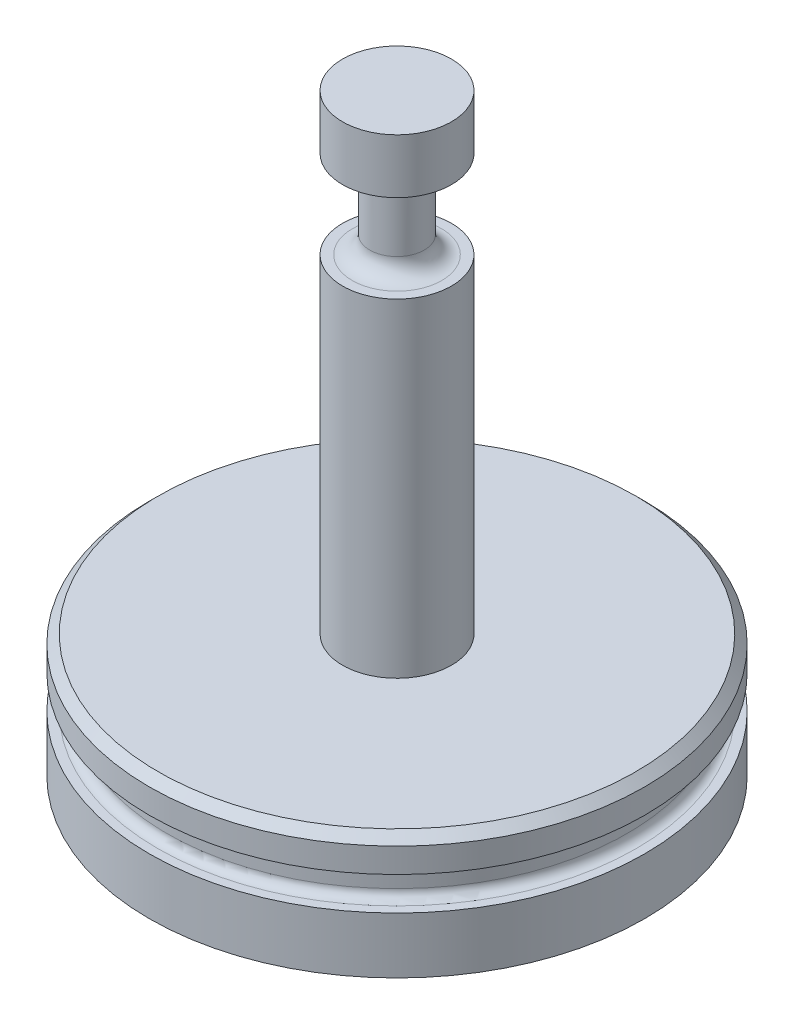
ISO-10303-21;
HEADER;
FILE_DESCRIPTION(('STEP AP214'),'2;1');
FILE_NAME('part.step','',(''),(''),'','','');
FILE_SCHEMA(('AUTOMOTIVE_DESIGN { 1 0 10303 214 1 1 1 1 }'));
ENDSEC;
DATA;
#1=APPLICATION_CONTEXT('core data for automotive mechanical design processes');
#2=APPLICATION_PROTOCOL_DEFINITION('international standard','automotive_design',2000,#1);
#3=PRODUCT_CONTEXT('',#1,'mechanical');
#4=PRODUCT('Part','Part','',(#3));
#5=PRODUCT_RELATED_PRODUCT_CATEGORY('part','',(#4));
#6=PRODUCT_DEFINITION_FORMATION('','',#4);
#7=PRODUCT_DEFINITION_CONTEXT('part definition',#1,'design');
#8=PRODUCT_DEFINITION('design','',#6,#7);
#9=PRODUCT_DEFINITION_SHAPE('','',#8);
#10=(LENGTH_UNIT() NAMED_UNIT(*) SI_UNIT(.MILLI.,.METRE.));
#11=(NAMED_UNIT(*) PLANE_ANGLE_UNIT() SI_UNIT($,.RADIAN.));
#12=(NAMED_UNIT(*) SI_UNIT($,.STERADIAN.) SOLID_ANGLE_UNIT());
#13=UNCERTAINTY_MEASURE_WITH_UNIT(LENGTH_MEASURE(1.E-05),#10,'distance_accuracy_value','');
#14=(GEOMETRIC_REPRESENTATION_CONTEXT(3) GLOBAL_UNCERTAINTY_ASSIGNED_CONTEXT((#13)) GLOBAL_UNIT_ASSIGNED_CONTEXT((#10,
#11,#12)) REPRESENTATION_CONTEXT('',''));
#15=CARTESIAN_POINT('',(0.,0.,0.));
#16=DIRECTION('',(0.,0.,1.));
#17=DIRECTION('',(1.,0.,0.));
#18=AXIS2_PLACEMENT_3D('',#15,#16,#17);
#19=CARTESIAN_POINT('',(0.,8.5852,0.));
#20=DIRECTION('',(0.,-1.,0.));
#21=DIRECTION('',(0.,0.,-1.));
#22=AXIS2_PLACEMENT_3D('',#19,#20,#21);
#23=PLANE('',#22);
#24=CARTESIAN_POINT('',(0.,8.5852,0.));
#25=DIRECTION('',(0.,-1.,0.));
#26=DIRECTION('',(0.,0.,-1.));
#27=AXIS2_PLACEMENT_3D('',#24,#25,#26);
#28=CIRCLE('',#27,0.7874);
#29=CARTESIAN_POINT('',(0.,8.5852,-0.7874));
#30=VERTEX_POINT('',#29);
#31=EDGE_CURVE('E238',#30,#30,#28,.T.);
#32=ORIENTED_EDGE('',*,*,#31,.F.);
#33=EDGE_LOOP('',(#32));
#34=FACE_BOUND('',#33,.T.);
#35=ADVANCED_FACE('F16',(#34),#23,.F.);
#36=CARTESIAN_POINT('',(0.,8.92556,0.));
#37=DIRECTION('',(0.,-1.,0.));
#38=DIRECTION('',(0.,0.,-1.));
#39=AXIS2_PLACEMENT_3D('',#36,#37,#38);
#40=CYLINDRICAL_SURFACE('',#39,0.7874);
#41=CARTESIAN_POINT('',(0.,7.7978,0.));
#42=DIRECTION('',(0.,-1.,0.));
#43=DIRECTION('',(0.,0.,-1.));
#44=AXIS2_PLACEMENT_3D('',#41,#42,#43);
#45=CIRCLE('',#44,0.7874);
#46=CARTESIAN_POINT('',(0.,7.7978,-0.7874));
#47=VERTEX_POINT('',#46);
#48=EDGE_CURVE('E64',#47,#47,#45,.T.);
#49=ORIENTED_EDGE('',*,*,#48,.F.);
#50=EDGE_LOOP('',(#49));
#51=FACE_BOUND('',#50,.T.);
#52=ORIENTED_EDGE('',*,*,#31,.T.);
#53=EDGE_LOOP('',(#52));
#54=FACE_BOUND('',#53,.T.);
#55=ADVANCED_FACE('F242',(#51,#54),#40,.T.);
#56=CARTESIAN_POINT('',(0.,7.7978,0.));
#57=DIRECTION('',(0.,-1.,0.));
#58=DIRECTION('',(0.,0.,-1.));
#59=AXIS2_PLACEMENT_3D('',#56,#57,#58);
#60=PLANE('',#59);
#61=CARTESIAN_POINT('',(0.,7.79779999999973,0.));
#62=DIRECTION('',(0.,-1.,0.));
#63=DIRECTION('',(1.,0.,0.));
#64=AXIS2_PLACEMENT_3D('',#61,#62,#63);
#65=CIRCLE('',#64,0.647699626490841);
#66=CARTESIAN_POINT('',(-0.647699477087177,7.79779999999983,0.));
#67=VERTEX_POINT('',#66);
#68=CARTESIAN_POINT('',(0.647699477087177,7.79779999999983,0.));
#69=VERTEX_POINT('',#68);
#70=EDGE_CURVE('E62',#67,#69,#65,.F.);
#71=ORIENTED_EDGE('',*,*,#70,.T.);
#72=CARTESIAN_POINT('',(0.,7.7977999999989,0.));
#73=DIRECTION('',(0.,-1.,0.));
#74=DIRECTION('',(-1.,0.,0.));
#75=AXIS2_PLACEMENT_3D('',#72,#73,#74);
#76=CIRCLE('',#75,0.647699252981682);
#77=EDGE_CURVE('E56',#69,#67,#76,.F.);
#78=ORIENTED_EDGE('',*,*,#77,.T.);
#79=EDGE_LOOP('',(#71,#78));
#80=FACE_BOUND('',#79,.T.);
#81=ORIENTED_EDGE('',*,*,#48,.T.);
#82=EDGE_LOOP('',(#81));
#83=FACE_BOUND('',#82,.T.);
#84=ADVANCED_FACE('F60',(#80,#83),#60,.T.);
#85=CARTESIAN_POINT('',(0.,7.5438,0.));
#86=DIRECTION('',(0.,-1.,0.));
#87=DIRECTION('',(0.998655321020781,0.,-0.051841583664869));
#88=AXIS2_PLACEMENT_3D('',#85,#86,#87);
#89=TOROIDAL_SURFACE('',#88,0.6477,0.254);
#90=CARTESIAN_POINT('',(0.,7.5438,0.));
#91=DIRECTION('',(0.,-1.,0.));
#92=DIRECTION('',(0.,0.,-1.));
#93=AXIS2_PLACEMENT_3D('',#90,#91,#92);
#94=CIRCLE('',#93,0.3937);
#95=CARTESIAN_POINT('',(0.,7.5438,-0.3937));
#96=VERTEX_POINT('',#95);
#97=EDGE_CURVE('E69',#96,#96,#94,.T.);
#98=ORIENTED_EDGE('',*,*,#97,.F.);
#99=EDGE_LOOP('',(#98));
#100=FACE_BOUND('',#99,.T.);
#101=ORIENTED_EDGE('',*,*,#70,.F.);
#102=ORIENTED_EDGE('',*,*,#77,.F.);
#103=EDGE_LOOP('',(#101,#102));
#104=FACE_BOUND('',#103,.T.);
#105=ADVANCED_FACE('F68',(#100,#104),#89,.F.);
#106=CARTESIAN_POINT('',(0.,8.92556,0.));
#107=DIRECTION('',(0.,-1.,0.));
#108=DIRECTION('',(0.,0.,-1.));
#109=AXIS2_PLACEMENT_3D('',#106,#107,#108);
#110=CYLINDRICAL_SURFACE('',#109,0.3937);
#111=ORIENTED_EDGE('',*,*,#97,.T.);
#112=EDGE_LOOP('',(#111));
#113=FACE_BOUND('',#112,.T.);
#114=CARTESIAN_POINT('',(0.,6.7818,0.));
#115=DIRECTION('',(0.,-1.,0.));
#116=DIRECTION('',(0.998522522331282,0.,-0.054339418447149));
#117=AXIS2_PLACEMENT_3D('',#114,#115,#116);
#118=CIRCLE('',#117,0.3937);
#119=CARTESIAN_POINT('',(0.393118317041826,6.7818,-0.0213934290426426));
#120=VERTEX_POINT('',#119);
#121=EDGE_CURVE('E102',#120,#120,#118,.F.);
#122=ORIENTED_EDGE('',*,*,#121,.T.);
#123=EDGE_LOOP('',(#122));
#124=FACE_BOUND('',#123,.T.);
#125=ADVANCED_FACE('F86',(#113,#124),#110,.T.);
#126=CARTESIAN_POINT('',(0.,6.7818,0.));
#127=DIRECTION('',(0.,-1.,0.));
#128=DIRECTION('',(0.998522522331282,0.,-0.054339418447149));
#129=AXIS2_PLACEMENT_3D('',#126,#127,#128);
#130=TOROIDAL_SURFACE('',#129,0.6477,0.254);
#131=CARTESIAN_POINT('',(0.,6.52780000000011,0.));
#132=DIRECTION('',(0.,1.,0.));
#133=DIRECTION('',(-1.,0.,0.));
#134=AXIS2_PLACEMENT_3D('',#131,#132,#133);
#135=CIRCLE('',#134,0.647699760850237);
#136=CARTESIAN_POINT('',(-0.647699665190332,6.52780000000007,0.));
#137=VERTEX_POINT('',#136);
#138=CARTESIAN_POINT('',(0.647699665190332,6.52780000000007,0.));
#139=VERTEX_POINT('',#138);
#140=EDGE_CURVE('E138',#137,#139,#135,.T.);
#141=ORIENTED_EDGE('',*,*,#140,.T.);
#142=CARTESIAN_POINT('',(0.,6.52780000000045,0.));
#143=DIRECTION('',(0.,1.,0.));
#144=DIRECTION('',(1.,0.,0.));
#145=AXIS2_PLACEMENT_3D('',#142,#143,#144);
#146=CIRCLE('',#145,0.647699521700474);
#147=EDGE_CURVE('E105',#139,#137,#146,.T.);
#148=ORIENTED_EDGE('',*,*,#147,.T.);
#149=EDGE_LOOP('',(#141,#148));
#150=FACE_BOUND('',#149,.T.);
#151=ORIENTED_EDGE('',*,*,#121,.F.);
#152=EDGE_LOOP('',(#151));
#153=FACE_BOUND('',#152,.T.);
#154=ADVANCED_FACE('F110',(#150,#153),#130,.F.);
#155=CARTESIAN_POINT('',(0.,6.5278,0.));
#156=DIRECTION('',(0.,-1.,0.));
#157=DIRECTION('',(0.,0.,-1.));
#158=AXIS2_PLACEMENT_3D('',#155,#156,#157);
#159=PLANE('',#158);
#160=ORIENTED_EDGE('',*,*,#147,.F.);
#161=ORIENTED_EDGE('',*,*,#140,.F.);
#162=EDGE_LOOP('',(#160,#161));
#163=FACE_BOUND('',#162,.T.);
#164=CARTESIAN_POINT('',(0.,6.5278,0.));
#165=DIRECTION('',(0.,-1.,0.));
#166=DIRECTION('',(0.,0.,-1.));
#167=AXIS2_PLACEMENT_3D('',#164,#165,#166);
#168=CIRCLE('',#167,0.7874);
#169=CARTESIAN_POINT('',(0.,6.5278,-0.7874));
#170=VERTEX_POINT('',#169);
#171=EDGE_CURVE('E226',#170,#170,#168,.T.);
#172=ORIENTED_EDGE('',*,*,#171,.F.);
#173=EDGE_LOOP('',(#172));
#174=FACE_BOUND('',#173,.T.);
#175=ADVANCED_FACE('F119',(#163,#174),#159,.F.);
#176=CARTESIAN_POINT('',(0.,8.92556,0.));
#177=DIRECTION('',(0.,-1.,0.));
#178=DIRECTION('',(0.,0.,-1.));
#179=AXIS2_PLACEMENT_3D('',#176,#177,#178);
#180=CYLINDRICAL_SURFACE('',#179,0.7874);
#181=ORIENTED_EDGE('',*,*,#171,.T.);
#182=EDGE_LOOP('',(#181));
#183=FACE_BOUND('',#182,.T.);
#184=CARTESIAN_POINT('',(0.,1.778,0.));
#185=DIRECTION('',(0.,-1.,0.));
#186=DIRECTION('',(0.,0.,-1.));
#187=AXIS2_PLACEMENT_3D('',#184,#185,#186);
#188=CIRCLE('',#187,0.7874);
#189=CARTESIAN_POINT('',(0.,1.778,-0.7874));
#190=VERTEX_POINT('',#189);
#191=EDGE_CURVE('E228',#190,#190,#188,.F.);
#192=ORIENTED_EDGE('',*,*,#191,.T.);
#193=EDGE_LOOP('',(#192));
#194=FACE_BOUND('',#193,.T.);
#195=ADVANCED_FACE('F375',(#183,#194),#180,.T.);
#196=CARTESIAN_POINT('',(0.,1.778,0.));
#197=DIRECTION('',(0.,-1.,0.));
#198=DIRECTION('',(0.,0.,-1.));
#199=AXIS2_PLACEMENT_3D('',#196,#197,#198);
#200=PLANE('',#199);
#201=ORIENTED_EDGE('',*,*,#191,.F.);
#202=EDGE_LOOP('',(#201));
#203=FACE_BOUND('',#202,.T.);
#204=CARTESIAN_POINT('',(0.,1.77800000000161,0.));
#205=DIRECTION('',(0.,-1.,0.));
#206=DIRECTION('',(0.,0.,-1.));
#207=AXIS2_PLACEMENT_3D('',#204,#205,#206);
#208=CIRCLE('',#207,3.45440000000963);
#209=CARTESIAN_POINT('',(0.,1.77800000000161,-3.45440000000963));
#210=VERTEX_POINT('',#209);
#211=EDGE_CURVE('E152',#210,#210,#208,.T.);
#212=ORIENTED_EDGE('',*,*,#211,.F.);
#213=EDGE_LOOP('',(#212));
#214=FACE_BOUND('',#213,.T.);
#215=ADVANCED_FACE('F366',(#203,#214),#200,.F.);
#216=CARTESIAN_POINT('',(0.,1.65100000003804,0.));
#217=DIRECTION('',(0.,-1.,0.));
#218=DIRECTION('',(0.,0.,-1.));
#219=AXIS2_PLACEMENT_3D('',#216,#217,#218);
#220=CONICAL_SURFACE('',#219,3.58140000003004,0.785398163621241);
#221=CARTESIAN_POINT('',(0.,1.651,0.));
#222=DIRECTION('',(0.,-1.,0.));
#223=DIRECTION('',(0.,0.,-1.));
#224=AXIS2_PLACEMENT_3D('',#221,#222,#223);
#225=CIRCLE('',#224,3.5814);
#226=CARTESIAN_POINT('',(0.,1.651,-3.5814));
#227=VERTEX_POINT('',#226);
#228=EDGE_CURVE('E148',#227,#227,#225,.T.);
#229=ORIENTED_EDGE('',*,*,#228,.F.);
#230=EDGE_LOOP('',(#229));
#231=FACE_BOUND('',#230,.T.);
#232=ORIENTED_EDGE('',*,*,#211,.T.);
#233=EDGE_LOOP('',(#232));
#234=FACE_BOUND('',#233,.T.);
#235=ADVANCED_FACE('F358',(#231,#234),#220,.T.);
#236=CARTESIAN_POINT('',(0.,1.8669,0.));
#237=DIRECTION('',(0.,-1.,0.));
#238=DIRECTION('',(0.,0.,-1.));
#239=AXIS2_PLACEMENT_3D('',#236,#237,#238);
#240=CYLINDRICAL_SURFACE('',#239,3.5814);
#241=CARTESIAN_POINT('',(0.,1.2954,0.));
#242=DIRECTION('',(0.,-1.,0.));
#243=DIRECTION('',(0.,0.,-1.));
#244=AXIS2_PLACEMENT_3D('',#241,#242,#243);
#245=CIRCLE('',#244,3.5814);
#246=CARTESIAN_POINT('',(0.,1.2954,-3.5814));
#247=VERTEX_POINT('',#246);
#248=EDGE_CURVE('E151',#247,#247,#245,.T.);
#249=ORIENTED_EDGE('',*,*,#248,.F.);
#250=EDGE_LOOP('',(#249));
#251=FACE_BOUND('',#250,.T.);
#252=ORIENTED_EDGE('',*,*,#228,.T.);
#253=EDGE_LOOP('',(#252));
#254=FACE_BOUND('',#253,.T.);
#255=ADVANCED_FACE('F351',(#251,#254),#240,.T.);
#256=CARTESIAN_POINT('',(0.,1.2954,0.));
#257=DIRECTION('',(0.,-1.,0.));
#258=DIRECTION('',(0.,0.,-1.));
#259=AXIS2_PLACEMENT_3D('',#256,#257,#258);
#260=PLANE('',#259);
#261=CARTESIAN_POINT('',(0.,1.2954,0.));
#262=DIRECTION('',(0.,-1.,0.));
#263=DIRECTION('',(1.,0.,0.));
#264=AXIS2_PLACEMENT_3D('',#261,#262,#263);
#265=CIRCLE('',#264,3.4544);
#266=CARTESIAN_POINT('',(-3.4544,1.2954,0.));
#267=VERTEX_POINT('',#266);
#268=CARTESIAN_POINT('',(3.4544,1.2954,0.));
#269=VERTEX_POINT('',#268);
#270=EDGE_CURVE('E185',#267,#269,#265,.F.);
#271=ORIENTED_EDGE('',*,*,#270,.T.);
#272=CARTESIAN_POINT('',(0.,1.2954,0.));
#273=DIRECTION('',(0.,-1.,0.));
#274=DIRECTION('',(-1.,0.,0.));
#275=AXIS2_PLACEMENT_3D('',#272,#273,#274);
#276=CIRCLE('',#275,3.4544);
#277=EDGE_CURVE('E194',#269,#267,#276,.F.);
#278=ORIENTED_EDGE('',*,*,#277,.T.);
#279=EDGE_LOOP('',(#271,#278));
#280=FACE_BOUND('',#279,.T.);
#281=ORIENTED_EDGE('',*,*,#248,.T.);
#282=EDGE_LOOP('',(#281));
#283=FACE_BOUND('',#282,.T.);
#284=ADVANCED_FACE('F171',(#280,#283),#260,.T.);
#285=CARTESIAN_POINT('',(0.,1.1684,0.));
#286=DIRECTION('',(0.,-1.,0.));
#287=DIRECTION('',(-1.,0.,0.));
#288=AXIS2_PLACEMENT_3D('',#285,#286,#287);
#289=TOROIDAL_SURFACE('',#288,3.4544,0.127);
#290=ORIENTED_EDGE('',*,*,#277,.F.);
#291=ORIENTED_EDGE('',*,*,#270,.F.);
#292=EDGE_LOOP('',(#290,#291));
#293=FACE_BOUND('',#292,.T.);
#294=CARTESIAN_POINT('',(0.,1.1684,0.));
#295=DIRECTION('',(0.,-1.,0.));
#296=DIRECTION('',(0.,0.,-1.));
#297=AXIS2_PLACEMENT_3D('',#294,#295,#296);
#298=CIRCLE('',#297,3.3274);
#299=CARTESIAN_POINT('',(0.,1.1684,-3.3274));
#300=VERTEX_POINT('',#299);
#301=EDGE_CURVE('E180',#300,#300,#298,.T.);
#302=ORIENTED_EDGE('',*,*,#301,.F.);
#303=EDGE_LOOP('',(#302));
#304=FACE_BOUND('',#303,.T.);
#305=ADVANCED_FACE('F159',(#293,#304),#289,.F.);
#306=CARTESIAN_POINT('',(0.,1.8669,0.));
#307=DIRECTION('',(0.,-1.,0.));
#308=DIRECTION('',(0.,0.,-1.));
#309=AXIS2_PLACEMENT_3D('',#306,#307,#308);
#310=CYLINDRICAL_SURFACE('',#309,3.3274);
#311=ORIENTED_EDGE('',*,*,#301,.T.);
#312=EDGE_LOOP('',(#311));
#313=FACE_BOUND('',#312,.T.);
#314=CARTESIAN_POINT('',(0.,0.9398,0.));
#315=DIRECTION('',(0.,-1.,0.));
#316=DIRECTION('',(-1.,0.,0.));
#317=AXIS2_PLACEMENT_3D('',#314,#315,#316);
#318=CIRCLE('',#317,3.3274);
#319=CARTESIAN_POINT('',(-3.3274,0.9398,0.));
#320=VERTEX_POINT('',#319);
#321=EDGE_CURVE('E286',#320,#320,#318,.F.);
#322=ORIENTED_EDGE('',*,*,#321,.T.);
#323=EDGE_LOOP('',(#322));
#324=FACE_BOUND('',#323,.T.);
#325=ADVANCED_FACE('F170',(#313,#324),#310,.T.);
#326=CARTESIAN_POINT('',(0.,0.9398,0.));
#327=DIRECTION('',(0.,-1.,0.));
#328=DIRECTION('',(-1.,0.,0.));
#329=AXIS2_PLACEMENT_3D('',#326,#327,#328);
#330=TOROIDAL_SURFACE('',#329,3.4544,0.127);
#331=ORIENTED_EDGE('',*,*,#321,.F.);
#332=EDGE_LOOP('',(#331));
#333=FACE_BOUND('',#332,.T.);
#334=CARTESIAN_POINT('',(0.,0.8128,0.));
#335=DIRECTION('',(0.,1.,0.));
#336=DIRECTION('',(1.,0.,0.));
#337=AXIS2_PLACEMENT_3D('',#334,#335,#336);
#338=CIRCLE('',#337,3.4544);
#339=CARTESIAN_POINT('',(3.4544,0.8128,0.));
#340=VERTEX_POINT('',#339);
#341=CARTESIAN_POINT('',(-3.4544,0.8128,0.));
#342=VERTEX_POINT('',#341);
#343=EDGE_CURVE('E282',#340,#342,#338,.T.);
#344=ORIENTED_EDGE('',*,*,#343,.T.);
#345=CARTESIAN_POINT('',(0.,0.8128,0.));
#346=DIRECTION('',(0.,1.,0.));
#347=DIRECTION('',(-1.,0.,0.));
#348=AXIS2_PLACEMENT_3D('',#345,#346,#347);
#349=CIRCLE('',#348,3.4544);
#350=EDGE_CURVE('E35',#342,#340,#349,.T.);
#351=ORIENTED_EDGE('',*,*,#350,.T.);
#352=EDGE_LOOP('',(#344,#351));
#353=FACE_BOUND('',#352,.T.);
#354=ADVANCED_FACE('F264',(#333,#353),#330,.F.);
#355=CARTESIAN_POINT('',(0.,0.8128,0.));
#356=DIRECTION('',(0.,-1.,0.));
#357=DIRECTION('',(0.,0.,-1.));
#358=AXIS2_PLACEMENT_3D('',#355,#356,#357);
#359=PLANE('',#358);
#360=ORIENTED_EDGE('',*,*,#350,.F.);
#361=ORIENTED_EDGE('',*,*,#343,.F.);
#362=EDGE_LOOP('',(#360,#361));
#363=FACE_BOUND('',#362,.T.);
#364=CARTESIAN_POINT('',(0.,0.8128,0.));
#365=DIRECTION('',(0.,-1.,0.));
#366=DIRECTION('',(0.,0.,-1.));
#367=AXIS2_PLACEMENT_3D('',#364,#365,#366);
#368=CIRCLE('',#367,3.5814);
#369=CARTESIAN_POINT('',(0.,0.8128,-3.5814));
#370=VERTEX_POINT('',#369);
#371=EDGE_CURVE('E27',#370,#370,#368,.T.);
#372=ORIENTED_EDGE('',*,*,#371,.F.);
#373=EDGE_LOOP('',(#372));
#374=FACE_BOUND('',#373,.T.);
#375=ADVANCED_FACE('F258',(#363,#374),#359,.F.);
#376=CARTESIAN_POINT('',(0.,1.8669,0.));
#377=DIRECTION('',(0.,-1.,0.));
#378=DIRECTION('',(0.,0.,-1.));
#379=AXIS2_PLACEMENT_3D('',#376,#377,#378);
#380=CYLINDRICAL_SURFACE('',#379,3.5814);
#381=ORIENTED_EDGE('',*,*,#371,.T.);
#382=EDGE_LOOP('',(#381));
#383=FACE_BOUND('',#382,.T.);
#384=CARTESIAN_POINT('',(0.,0.,0.));
#385=DIRECTION('',(0.,-1.,0.));
#386=DIRECTION('',(0.,0.,-1.));
#387=AXIS2_PLACEMENT_3D('',#384,#385,#386);
#388=CIRCLE('',#387,3.5814);
#389=CARTESIAN_POINT('',(0.,0.,-3.5814));
#390=VERTEX_POINT('',#389);
#391=EDGE_CURVE('E11',#390,#390,#388,.T.);
#392=ORIENTED_EDGE('',*,*,#391,.F.);
#393=EDGE_LOOP('',(#392));
#394=FACE_BOUND('',#393,.T.);
#395=ADVANCED_FACE('F252',(#383,#394),#380,.T.);
#396=CARTESIAN_POINT('',(0.,0.,0.));
#397=DIRECTION('',(0.,-1.,0.));
#398=DIRECTION('',(0.,0.,-1.));
#399=AXIS2_PLACEMENT_3D('',#396,#397,#398);
#400=PLANE('',#399);
#401=ORIENTED_EDGE('',*,*,#391,.T.);
#402=EDGE_LOOP('',(#401));
#403=FACE_BOUND('',#402,.T.);
#404=ADVANCED_FACE('F250',(#403),#400,.T.);
#405=CLOSED_SHELL('',(#35,#55,#84,#105,#125,#154,#175,#195,#215,#235,#255,#284,#305,#325,#354,
#375,#395,#404));
#406=MANIFOLD_SOLID_BREP('B1',#405);
#407=ADVANCED_BREP_SHAPE_REPRESENTATION('',(#18,#406),#14);
#408=SHAPE_DEFINITION_REPRESENTATION(#9,#407);
ENDSEC;
END-ISO-10303-21;
